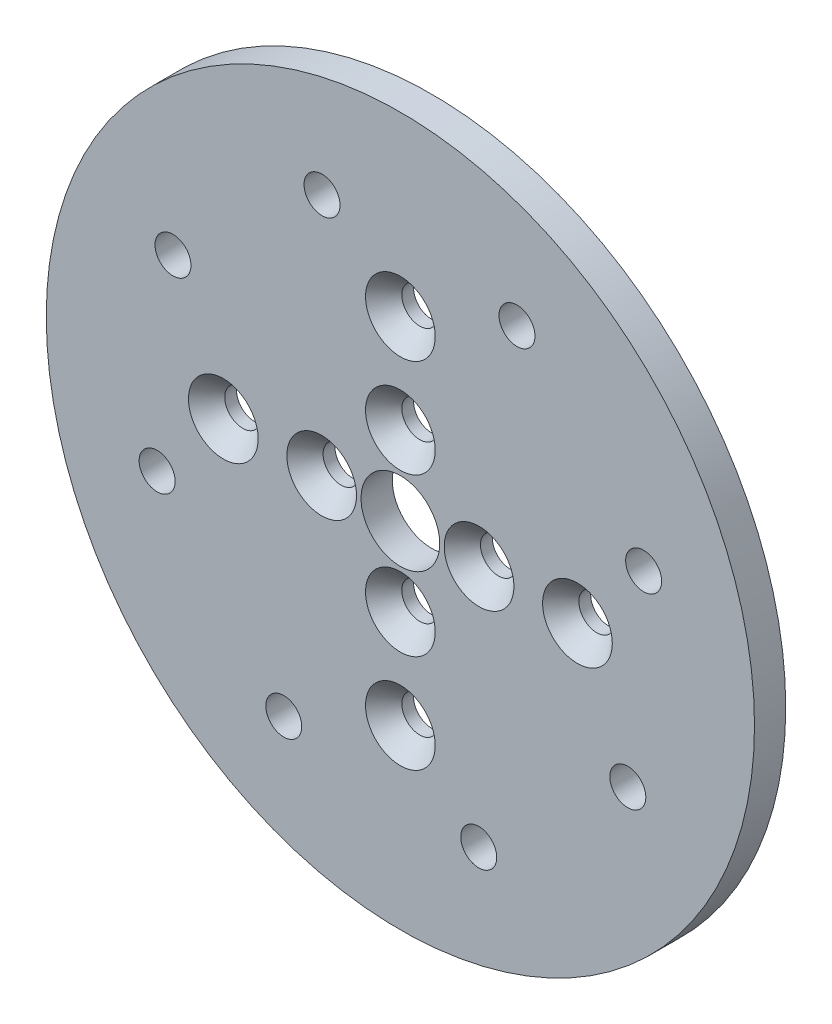
ISO-10303-21;
HEADER;
FILE_DESCRIPTION(('STEP AP214'),'2;1');
FILE_NAME('part.step','',(''),(''),'','','');
FILE_SCHEMA(('AUTOMOTIVE_DESIGN { 1 0 10303 214 1 1 1 1 }'));
ENDSEC;
DATA;
#1=APPLICATION_CONTEXT('core data for automotive mechanical design processes');
#2=APPLICATION_PROTOCOL_DEFINITION('international standard','automotive_design',2000,#1);
#3=PRODUCT_CONTEXT('',#1,'mechanical');
#4=PRODUCT('Part','Part','',(#3));
#5=PRODUCT_RELATED_PRODUCT_CATEGORY('part','',(#4));
#6=PRODUCT_DEFINITION_FORMATION('','',#4);
#7=PRODUCT_DEFINITION_CONTEXT('part definition',#1,'design');
#8=PRODUCT_DEFINITION('design','',#6,#7);
#9=PRODUCT_DEFINITION_SHAPE('','',#8);
#10=(LENGTH_UNIT() NAMED_UNIT(*) SI_UNIT(.MILLI.,.METRE.));
#11=(NAMED_UNIT(*) PLANE_ANGLE_UNIT() SI_UNIT($,.RADIAN.));
#12=(NAMED_UNIT(*) SI_UNIT($,.STERADIAN.) SOLID_ANGLE_UNIT());
#13=UNCERTAINTY_MEASURE_WITH_UNIT(LENGTH_MEASURE(1.E-05),#10,'distance_accuracy_value','');
#14=(GEOMETRIC_REPRESENTATION_CONTEXT(3) GLOBAL_UNCERTAINTY_ASSIGNED_CONTEXT((#13)) GLOBAL_UNIT_ASSIGNED_CONTEXT((#10,
#11,#12)) REPRESENTATION_CONTEXT('',''));
#15=CARTESIAN_POINT('',(0.,0.,0.));
#16=DIRECTION('',(0.,0.,1.));
#17=DIRECTION('',(1.,0.,0.));
#18=AXIS2_PLACEMENT_3D('',#15,#16,#17);
#19=CARTESIAN_POINT('',(0.,0.,3.175));
#20=DIRECTION('',(0.,0.,-1.));
#21=DIRECTION('',(-1.,0.,0.));
#22=AXIS2_PLACEMENT_3D('',#19,#20,#21);
#23=PLANE('',#22);
#24=CARTESIAN_POINT('',(18.0000000000002,-1.66533453693773E-13,3.175));
#25=DIRECTION('',(0.,0.,1.));
#26=DIRECTION('',(1.,0.,0.));
#27=AXIS2_PLACEMENT_3D('',#24,#25,#26);
#28=CIRCLE('',#27,3.5433);
#29=CARTESIAN_POINT('',(21.5433000000002,-1.66533453693773E-13,3.175));
#30=VERTEX_POINT('',#29);
#31=EDGE_CURVE('E90',#30,#30,#28,.T.);
#32=ORIENTED_EDGE('',*,*,#31,.F.);
#33=EDGE_LOOP('',(#32));
#34=FACE_BOUND('',#33,.T.);
#35=CARTESIAN_POINT('',(2.08166817117217E-13,-18.0000000000002,3.175));
#36=DIRECTION('',(0.,0.,1.));
#37=DIRECTION('',(1.,0.,0.));
#38=AXIS2_PLACEMENT_3D('',#35,#36,#37);
#39=CIRCLE('',#38,3.5433);
#40=CARTESIAN_POINT('',(3.54330000000021,-18.0000000000002,3.175));
#41=VERTEX_POINT('',#40);
#42=EDGE_CURVE('E83',#41,#41,#39,.T.);
#43=ORIENTED_EDGE('',*,*,#42,.F.);
#44=EDGE_LOOP('',(#43));
#45=FACE_BOUND('',#44,.T.);
#46=CARTESIAN_POINT('',(-18.0000000000002,0.,3.175));
#47=DIRECTION('',(0.,0.,1.));
#48=DIRECTION('',(1.,0.,0.));
#49=AXIS2_PLACEMENT_3D('',#46,#47,#48);
#50=CIRCLE('',#49,3.5433);
#51=CARTESIAN_POINT('',(-14.4567000000002,0.,3.175));
#52=VERTEX_POINT('',#51);
#53=EDGE_CURVE('E79',#52,#52,#50,.T.);
#54=ORIENTED_EDGE('',*,*,#53,.F.);
#55=EDGE_LOOP('',(#54));
#56=FACE_BOUND('',#55,.T.);
#57=CARTESIAN_POINT('',(0.,8.,3.175));
#58=DIRECTION('',(0.,0.,1.));
#59=DIRECTION('',(1.,0.,0.));
#60=AXIS2_PLACEMENT_3D('',#57,#58,#59);
#61=CIRCLE('',#60,3.5433);
#62=CARTESIAN_POINT('',(3.5433,8.,3.175));
#63=VERTEX_POINT('',#62);
#64=EDGE_CURVE('E75',#63,#63,#61,.T.);
#65=ORIENTED_EDGE('',*,*,#64,.F.);
#66=EDGE_LOOP('',(#65));
#67=FACE_BOUND('',#66,.T.);
#68=CARTESIAN_POINT('',(8.,0.,3.175));
#69=DIRECTION('',(0.,0.,1.));
#70=DIRECTION('',(1.,0.,0.));
#71=AXIS2_PLACEMENT_3D('',#68,#69,#70);
#72=CIRCLE('',#71,3.5433);
#73=CARTESIAN_POINT('',(11.5433,0.,3.175));
#74=VERTEX_POINT('',#73);
#75=EDGE_CURVE('E70',#74,#74,#72,.T.);
#76=ORIENTED_EDGE('',*,*,#75,.F.);
#77=EDGE_LOOP('',(#76));
#78=FACE_BOUND('',#77,.T.);
#79=CARTESIAN_POINT('',(0.,-8.,3.175));
#80=DIRECTION('',(0.,0.,1.));
#81=DIRECTION('',(1.,0.,0.));
#82=AXIS2_PLACEMENT_3D('',#79,#80,#81);
#83=CIRCLE('',#82,3.5433);
#84=CARTESIAN_POINT('',(3.5433,-8.,3.175));
#85=VERTEX_POINT('',#84);
#86=EDGE_CURVE('E65',#85,#85,#83,.T.);
#87=ORIENTED_EDGE('',*,*,#86,.F.);
#88=EDGE_LOOP('',(#87));
#89=FACE_BOUND('',#88,.T.);
#90=CARTESIAN_POINT('',(-8.,0.,3.175));
#91=DIRECTION('',(0.,0.,1.));
#92=DIRECTION('',(1.,0.,0.));
#93=AXIS2_PLACEMENT_3D('',#90,#91,#92);
#94=CIRCLE('',#93,3.5433);
#95=CARTESIAN_POINT('',(-4.4567,0.,3.175));
#96=VERTEX_POINT('',#95);
#97=EDGE_CURVE('E60',#96,#96,#94,.T.);
#98=ORIENTED_EDGE('',*,*,#97,.F.);
#99=EDGE_LOOP('',(#98));
#100=FACE_BOUND('',#99,.T.);
#101=CARTESIAN_POINT('',(-11.8531754583399,-23.1184478621254,3.175));
#102=DIRECTION('',(0.,0.,-1.));
#103=DIRECTION('',(-1.,0.,0.));
#104=AXIS2_PLACEMENT_3D('',#101,#102,#103);
#105=CIRCLE('',#104,1.82879999999999);
#106=CARTESIAN_POINT('',(-13.6819754583399,-23.1184478621254,3.175));
#107=VERTEX_POINT('',#106);
#108=EDGE_CURVE('E122',#107,#107,#105,.T.);
#109=ORIENTED_EDGE('',*,*,#108,.T.);
#110=EDGE_LOOP('',(#109));
#111=FACE_BOUND('',#110,.T.);
#112=CARTESIAN_POINT('',(24.7286719990026,7.96575050863032,3.175));
#113=DIRECTION('',(0.,0.,-1.));
#114=DIRECTION('',(-1.,0.,0.));
#115=AXIS2_PLACEMENT_3D('',#112,#113,#114);
#116=CIRCLE('',#115,1.82879999999999);
#117=CARTESIAN_POINT('',(22.8998719990026,7.96575050863032,3.175));
#118=VERTEX_POINT('',#117);
#119=EDGE_CURVE('E128',#118,#118,#116,.T.);
#120=ORIENTED_EDGE('',*,*,#119,.T.);
#121=EDGE_LOOP('',(#120));
#122=FACE_BOUND('',#121,.T.);
#123=CARTESIAN_POINT('',(11.8531754583399,23.1184478621254,3.175));
#124=DIRECTION('',(0.,0.,-1.));
#125=DIRECTION('',(-1.,0.,0.));
#126=AXIS2_PLACEMENT_3D('',#123,#124,#125);
#127=CIRCLE('',#126,1.82879999999999);
#128=CARTESIAN_POINT('',(10.0243754583399,23.1184478621254,3.175));
#129=VERTEX_POINT('',#128);
#130=EDGE_CURVE('E134',#129,#129,#127,.T.);
#131=ORIENTED_EDGE('',*,*,#130,.T.);
#132=EDGE_LOOP('',(#131));
#133=FACE_BOUND('',#132,.T.);
#134=CARTESIAN_POINT('',(-7.96575050863032,24.7286719990026,3.175));
#135=DIRECTION('',(0.,0.,-1.));
#136=DIRECTION('',(-1.,0.,0.));
#137=AXIS2_PLACEMENT_3D('',#134,#135,#136);
#138=CIRCLE('',#137,1.82879999999999);
#139=CARTESIAN_POINT('',(-9.79455050863031,24.7286719990026,3.175));
#140=VERTEX_POINT('',#139);
#141=EDGE_CURVE('E140',#140,#140,#138,.T.);
#142=ORIENTED_EDGE('',*,*,#141,.T.);
#143=EDGE_LOOP('',(#142));
#144=FACE_BOUND('',#143,.T.);
#145=CARTESIAN_POINT('',(-23.1184478621253,11.85317545834,3.175));
#146=DIRECTION('',(0.,0.,-1.));
#147=DIRECTION('',(-1.,0.,0.));
#148=AXIS2_PLACEMENT_3D('',#145,#146,#147);
#149=CIRCLE('',#148,1.82879999999999);
#150=CARTESIAN_POINT('',(-24.9472478621253,11.85317545834,3.175));
#151=VERTEX_POINT('',#150);
#152=EDGE_CURVE('E146',#151,#151,#149,.T.);
#153=ORIENTED_EDGE('',*,*,#152,.T.);
#154=EDGE_LOOP('',(#153));
#155=FACE_BOUND('',#154,.T.);
#156=CARTESIAN_POINT('',(-24.7286719990026,-7.96575050863032,3.175));
#157=DIRECTION('',(0.,0.,-1.));
#158=DIRECTION('',(-1.,0.,0.));
#159=AXIS2_PLACEMENT_3D('',#156,#157,#158);
#160=CIRCLE('',#159,1.82879999999999);
#161=CARTESIAN_POINT('',(-26.5574719990026,-7.96575050863032,3.175));
#162=VERTEX_POINT('',#161);
#163=EDGE_CURVE('E152',#162,#162,#160,.T.);
#164=ORIENTED_EDGE('',*,*,#163,.T.);
#165=EDGE_LOOP('',(#164));
#166=FACE_BOUND('',#165,.T.);
#167=CARTESIAN_POINT('',(7.96575050863032,-24.7286719990026,3.175));
#168=DIRECTION('',(0.,0.,-1.));
#169=DIRECTION('',(-1.,0.,0.));
#170=AXIS2_PLACEMENT_3D('',#167,#168,#169);
#171=CIRCLE('',#170,1.82879999999999);
#172=CARTESIAN_POINT('',(6.13695050863033,-24.7286719990026,3.175));
#173=VERTEX_POINT('',#172);
#174=EDGE_CURVE('E158',#173,#173,#171,.T.);
#175=ORIENTED_EDGE('',*,*,#174,.T.);
#176=EDGE_LOOP('',(#175));
#177=FACE_BOUND('',#176,.T.);
#178=CARTESIAN_POINT('',(23.1184478621253,-11.85317545834,3.175));
#179=DIRECTION('',(0.,0.,-1.));
#180=DIRECTION('',(-1.,0.,0.));
#181=AXIS2_PLACEMENT_3D('',#178,#179,#180);
#182=CIRCLE('',#181,1.82879999999999);
#183=CARTESIAN_POINT('',(21.2896478621253,-11.85317545834,3.175));
#184=VERTEX_POINT('',#183);
#185=EDGE_CURVE('E164',#184,#184,#182,.T.);
#186=ORIENTED_EDGE('',*,*,#185,.T.);
#187=EDGE_LOOP('',(#186));
#188=FACE_BOUND('',#187,.T.);
#189=CARTESIAN_POINT('',(0.,0.,3.175));
#190=DIRECTION('',(0.,0.,1.));
#191=DIRECTION('',(-1.,0.,0.));
#192=AXIS2_PLACEMENT_3D('',#189,#190,#191);
#193=CIRCLE('',#192,36.);
#194=CARTESIAN_POINT('',(-36.,0.,3.175));
#195=VERTEX_POINT('',#194);
#196=EDGE_CURVE('E10',#195,#195,#193,.T.);
#197=ORIENTED_EDGE('',*,*,#196,.T.);
#198=EDGE_LOOP('',(#197));
#199=FACE_BOUND('',#198,.T.);
#200=CARTESIAN_POINT('',(0.,0.,3.175));
#201=DIRECTION('',(0.,0.,1.));
#202=DIRECTION('',(1.,0.,0.));
#203=AXIS2_PLACEMENT_3D('',#200,#201,#202);
#204=CIRCLE('',#203,4.);
#205=CARTESIAN_POINT('',(4.00000000000001,0.,3.175));
#206=VERTEX_POINT('',#205);
#207=EDGE_CURVE('E46',#206,#206,#204,.T.);
#208=ORIENTED_EDGE('',*,*,#207,.F.);
#209=EDGE_LOOP('',(#208));
#210=FACE_BOUND('',#209,.T.);
#211=CARTESIAN_POINT('',(2.08166817117217E-13,17.9999999999998,3.175));
#212=DIRECTION('',(0.,0.,1.));
#213=DIRECTION('',(1.,0.,0.));
#214=AXIS2_PLACEMENT_3D('',#211,#212,#213);
#215=CIRCLE('',#214,3.5433);
#216=CARTESIAN_POINT('',(3.54330000000021,17.9999999999998,3.175));
#217=VERTEX_POINT('',#216);
#218=EDGE_CURVE('E226',#217,#217,#215,.T.);
#219=ORIENTED_EDGE('',*,*,#218,.F.);
#220=EDGE_LOOP('',(#219));
#221=FACE_BOUND('',#220,.T.);
#222=ADVANCED_FACE('F33',(#34,#45,#56,#67,#78,#89,#100,#111,#122,#133,#144,#155,#166,#177,#188,
#199,#210,#221),#23,.F.);
#223=CARTESIAN_POINT('',(0.,0.,0.));
#224=DIRECTION('',(0.,0.,-1.));
#225=DIRECTION('',(-1.,0.,0.));
#226=AXIS2_PLACEMENT_3D('',#223,#224,#225);
#227=PLANE('',#226);
#228=CARTESIAN_POINT('',(2.08166817117217E-13,17.9999999999998,0.));
#229=DIRECTION('',(0.,0.,-1.));
#230=DIRECTION('',(-1.,0.,0.));
#231=AXIS2_PLACEMENT_3D('',#228,#229,#230);
#232=CIRCLE('',#231,1.82879999999999);
#233=CARTESIAN_POINT('',(-1.82879999999978,17.9999999999998,0.));
#234=VERTEX_POINT('',#233);
#235=EDGE_CURVE('E37',#234,#234,#232,.T.);
#236=ORIENTED_EDGE('',*,*,#235,.F.);
#237=EDGE_LOOP('',(#236));
#238=FACE_BOUND('',#237,.T.);
#239=CARTESIAN_POINT('',(18.0000000000002,-1.66533453693773E-13,0.));
#240=DIRECTION('',(0.,0.,-1.));
#241=DIRECTION('',(-1.,0.,0.));
#242=AXIS2_PLACEMENT_3D('',#239,#240,#241);
#243=CIRCLE('',#242,1.82879999999999);
#244=CARTESIAN_POINT('',(16.1712000000002,-1.66533453693773E-13,0.));
#245=VERTEX_POINT('',#244);
#246=EDGE_CURVE('E81',#245,#245,#243,.T.);
#247=ORIENTED_EDGE('',*,*,#246,.F.);
#248=EDGE_LOOP('',(#247));
#249=FACE_BOUND('',#248,.T.);
#250=CARTESIAN_POINT('',(2.08166817117217E-13,-18.0000000000002,0.));
#251=DIRECTION('',(0.,0.,-1.));
#252=DIRECTION('',(-1.,0.,0.));
#253=AXIS2_PLACEMENT_3D('',#250,#251,#252);
#254=CIRCLE('',#253,1.82879999999999);
#255=CARTESIAN_POINT('',(-1.82879999999978,-18.0000000000002,0.));
#256=VERTEX_POINT('',#255);
#257=EDGE_CURVE('E77',#256,#256,#254,.T.);
#258=ORIENTED_EDGE('',*,*,#257,.F.);
#259=EDGE_LOOP('',(#258));
#260=FACE_BOUND('',#259,.T.);
#261=CARTESIAN_POINT('',(-18.0000000000002,0.,0.));
#262=DIRECTION('',(0.,0.,-1.));
#263=DIRECTION('',(-1.,0.,0.));
#264=AXIS2_PLACEMENT_3D('',#261,#262,#263);
#265=CIRCLE('',#264,1.82879999999999);
#266=CARTESIAN_POINT('',(-19.8288000000002,0.,0.));
#267=VERTEX_POINT('',#266);
#268=EDGE_CURVE('E72',#267,#267,#265,.T.);
#269=ORIENTED_EDGE('',*,*,#268,.F.);
#270=EDGE_LOOP('',(#269));
#271=FACE_BOUND('',#270,.T.);
#272=CARTESIAN_POINT('',(0.,8.,0.));
#273=DIRECTION('',(0.,0.,-1.));
#274=DIRECTION('',(-1.,0.,0.));
#275=AXIS2_PLACEMENT_3D('',#272,#273,#274);
#276=CIRCLE('',#275,1.82879999999999);
#277=CARTESIAN_POINT('',(-1.82879999999999,8.,0.));
#278=VERTEX_POINT('',#277);
#279=EDGE_CURVE('E67',#278,#278,#276,.T.);
#280=ORIENTED_EDGE('',*,*,#279,.F.);
#281=EDGE_LOOP('',(#280));
#282=FACE_BOUND('',#281,.T.);
#283=CARTESIAN_POINT('',(8.,0.,0.));
#284=DIRECTION('',(0.,0.,-1.));
#285=DIRECTION('',(-1.,0.,0.));
#286=AXIS2_PLACEMENT_3D('',#283,#284,#285);
#287=CIRCLE('',#286,1.82879999999999);
#288=CARTESIAN_POINT('',(6.17120000000001,0.,0.));
#289=VERTEX_POINT('',#288);
#290=EDGE_CURVE('E62',#289,#289,#287,.T.);
#291=ORIENTED_EDGE('',*,*,#290,.F.);
#292=EDGE_LOOP('',(#291));
#293=FACE_BOUND('',#292,.T.);
#294=CARTESIAN_POINT('',(0.,-8.,0.));
#295=DIRECTION('',(0.,0.,-1.));
#296=DIRECTION('',(-1.,0.,0.));
#297=AXIS2_PLACEMENT_3D('',#294,#295,#296);
#298=CIRCLE('',#297,1.82879999999999);
#299=CARTESIAN_POINT('',(-1.82879999999999,-8.,0.));
#300=VERTEX_POINT('',#299);
#301=EDGE_CURVE('E57',#300,#300,#298,.T.);
#302=ORIENTED_EDGE('',*,*,#301,.F.);
#303=EDGE_LOOP('',(#302));
#304=FACE_BOUND('',#303,.T.);
#305=CARTESIAN_POINT('',(-8.,0.,0.));
#306=DIRECTION('',(0.,0.,-1.));
#307=DIRECTION('',(-1.,0.,0.));
#308=AXIS2_PLACEMENT_3D('',#305,#306,#307);
#309=CIRCLE('',#308,1.82879999999999);
#310=CARTESIAN_POINT('',(-9.82879999999999,0.,0.));
#311=VERTEX_POINT('',#310);
#312=EDGE_CURVE('E52',#311,#311,#309,.T.);
#313=ORIENTED_EDGE('',*,*,#312,.F.);
#314=EDGE_LOOP('',(#313));
#315=FACE_BOUND('',#314,.T.);
#316=CARTESIAN_POINT('',(-11.8531754583399,-23.1184478621254,0.));
#317=DIRECTION('',(0.,0.,-1.));
#318=DIRECTION('',(-1.,0.,0.));
#319=AXIS2_PLACEMENT_3D('',#316,#317,#318);
#320=CIRCLE('',#319,1.82879999999999);
#321=CARTESIAN_POINT('',(-13.6819754583399,-23.1184478621254,0.));
#322=VERTEX_POINT('',#321);
#323=EDGE_CURVE('E55',#322,#322,#320,.T.);
#324=ORIENTED_EDGE('',*,*,#323,.F.);
#325=EDGE_LOOP('',(#324));
#326=FACE_BOUND('',#325,.T.);
#327=CARTESIAN_POINT('',(24.7286719990026,7.96575050863032,0.));
#328=DIRECTION('',(0.,0.,-1.));
#329=DIRECTION('',(-1.,0.,0.));
#330=AXIS2_PLACEMENT_3D('',#327,#328,#329);
#331=CIRCLE('',#330,1.82879999999999);
#332=CARTESIAN_POINT('',(22.8998719990026,7.96575050863032,0.));
#333=VERTEX_POINT('',#332);
#334=EDGE_CURVE('E125',#333,#333,#331,.T.);
#335=ORIENTED_EDGE('',*,*,#334,.F.);
#336=EDGE_LOOP('',(#335));
#337=FACE_BOUND('',#336,.T.);
#338=CARTESIAN_POINT('',(11.8531754583399,23.1184478621254,0.));
#339=DIRECTION('',(0.,0.,-1.));
#340=DIRECTION('',(-1.,0.,0.));
#341=AXIS2_PLACEMENT_3D('',#338,#339,#340);
#342=CIRCLE('',#341,1.82879999999999);
#343=CARTESIAN_POINT('',(10.0243754583399,23.1184478621254,0.));
#344=VERTEX_POINT('',#343);
#345=EDGE_CURVE('E131',#344,#344,#342,.T.);
#346=ORIENTED_EDGE('',*,*,#345,.F.);
#347=EDGE_LOOP('',(#346));
#348=FACE_BOUND('',#347,.T.);
#349=CARTESIAN_POINT('',(-7.96575050863032,24.7286719990026,0.));
#350=DIRECTION('',(0.,0.,-1.));
#351=DIRECTION('',(-1.,0.,0.));
#352=AXIS2_PLACEMENT_3D('',#349,#350,#351);
#353=CIRCLE('',#352,1.82879999999999);
#354=CARTESIAN_POINT('',(-9.79455050863031,24.7286719990026,0.));
#355=VERTEX_POINT('',#354);
#356=EDGE_CURVE('E137',#355,#355,#353,.T.);
#357=ORIENTED_EDGE('',*,*,#356,.F.);
#358=EDGE_LOOP('',(#357));
#359=FACE_BOUND('',#358,.T.);
#360=CARTESIAN_POINT('',(-23.1184478621253,11.85317545834,0.));
#361=DIRECTION('',(0.,0.,-1.));
#362=DIRECTION('',(-1.,0.,0.));
#363=AXIS2_PLACEMENT_3D('',#360,#361,#362);
#364=CIRCLE('',#363,1.82879999999999);
#365=CARTESIAN_POINT('',(-24.9472478621253,11.85317545834,0.));
#366=VERTEX_POINT('',#365);
#367=EDGE_CURVE('E143',#366,#366,#364,.T.);
#368=ORIENTED_EDGE('',*,*,#367,.F.);
#369=EDGE_LOOP('',(#368));
#370=FACE_BOUND('',#369,.T.);
#371=CARTESIAN_POINT('',(-24.7286719990026,-7.96575050863032,0.));
#372=DIRECTION('',(0.,0.,-1.));
#373=DIRECTION('',(-1.,0.,0.));
#374=AXIS2_PLACEMENT_3D('',#371,#372,#373);
#375=CIRCLE('',#374,1.82879999999999);
#376=CARTESIAN_POINT('',(-26.5574719990026,-7.96575050863032,0.));
#377=VERTEX_POINT('',#376);
#378=EDGE_CURVE('E149',#377,#377,#375,.T.);
#379=ORIENTED_EDGE('',*,*,#378,.F.);
#380=EDGE_LOOP('',(#379));
#381=FACE_BOUND('',#380,.T.);
#382=CARTESIAN_POINT('',(7.96575050863032,-24.7286719990026,0.));
#383=DIRECTION('',(0.,0.,-1.));
#384=DIRECTION('',(-1.,0.,0.));
#385=AXIS2_PLACEMENT_3D('',#382,#383,#384);
#386=CIRCLE('',#385,1.82879999999999);
#387=CARTESIAN_POINT('',(6.13695050863033,-24.7286719990026,0.));
#388=VERTEX_POINT('',#387);
#389=EDGE_CURVE('E155',#388,#388,#386,.T.);
#390=ORIENTED_EDGE('',*,*,#389,.F.);
#391=EDGE_LOOP('',(#390));
#392=FACE_BOUND('',#391,.T.);
#393=CARTESIAN_POINT('',(23.1184478621253,-11.85317545834,0.));
#394=DIRECTION('',(0.,0.,-1.));
#395=DIRECTION('',(-1.,0.,0.));
#396=AXIS2_PLACEMENT_3D('',#393,#394,#395);
#397=CIRCLE('',#396,1.82879999999999);
#398=CARTESIAN_POINT('',(21.2896478621253,-11.85317545834,0.));
#399=VERTEX_POINT('',#398);
#400=EDGE_CURVE('E161',#399,#399,#397,.T.);
#401=ORIENTED_EDGE('',*,*,#400,.F.);
#402=EDGE_LOOP('',(#401));
#403=FACE_BOUND('',#402,.T.);
#404=CARTESIAN_POINT('',(0.,0.,0.));
#405=DIRECTION('',(0.,0.,1.));
#406=DIRECTION('',(1.,0.,0.));
#407=AXIS2_PLACEMENT_3D('',#404,#405,#406);
#408=CIRCLE('',#407,36.);
#409=CARTESIAN_POINT('',(36.,0.,0.));
#410=VERTEX_POINT('',#409);
#411=EDGE_CURVE('E41',#410,#410,#408,.T.);
#412=ORIENTED_EDGE('',*,*,#411,.F.);
#413=EDGE_LOOP('',(#412));
#414=FACE_BOUND('',#413,.T.);
#415=CARTESIAN_POINT('',(0.,0.,0.));
#416=DIRECTION('',(0.,0.,1.));
#417=DIRECTION('',(1.,0.,0.));
#418=AXIS2_PLACEMENT_3D('',#415,#416,#417);
#419=CIRCLE('',#418,4.);
#420=CARTESIAN_POINT('',(4.00000000000001,0.,0.));
#421=VERTEX_POINT('',#420);
#422=EDGE_CURVE('E49',#421,#421,#419,.T.);
#423=ORIENTED_EDGE('',*,*,#422,.T.);
#424=EDGE_LOOP('',(#423));
#425=FACE_BOUND('',#424,.T.);
#426=ADVANCED_FACE('F172',(#238,#249,#260,#271,#282,#293,#304,#315,#326,#337,#348,#359,#370,
#381,#392,#403,#414,#425),#227,.T.);
#427=CARTESIAN_POINT('',(0.,0.,3.175));
#428=DIRECTION('',(0.,0.,-1.));
#429=DIRECTION('',(-1.,0.,0.));
#430=AXIS2_PLACEMENT_3D('',#427,#428,#429);
#431=CYLINDRICAL_SURFACE('',#430,36.);
#432=ORIENTED_EDGE('',*,*,#411,.T.);
#433=EDGE_LOOP('',(#432));
#434=FACE_BOUND('',#433,.T.);
#435=ORIENTED_EDGE('',*,*,#196,.F.);
#436=EDGE_LOOP('',(#435));
#437=FACE_BOUND('',#436,.T.);
#438=ADVANCED_FACE('F35',(#434,#437),#431,.T.);
#439=CARTESIAN_POINT('',(0.,0.,3.175));
#440=DIRECTION('',(0.,0.,-1.));
#441=DIRECTION('',(-1.,0.,0.));
#442=AXIS2_PLACEMENT_3D('',#439,#440,#441);
#443=CYLINDRICAL_SURFACE('',#442,4.);
#444=ORIENTED_EDGE('',*,*,#207,.T.);
#445=EDGE_LOOP('',(#444));
#446=FACE_BOUND('',#445,.T.);
#447=ORIENTED_EDGE('',*,*,#422,.F.);
#448=EDGE_LOOP('',(#447));
#449=FACE_BOUND('',#448,.T.);
#450=ADVANCED_FACE('F174',(#446,#449),#443,.F.);
#451=CARTESIAN_POINT('',(23.1184478621253,-11.85317545834,0.));
#452=DIRECTION('',(0.,0.,-1.));
#453=DIRECTION('',(-1.,0.,0.));
#454=AXIS2_PLACEMENT_3D('',#451,#452,#453);
#455=CYLINDRICAL_SURFACE('',#454,1.82879999999999);
#456=ORIENTED_EDGE('',*,*,#400,.T.);
#457=EDGE_LOOP('',(#456));
#458=FACE_BOUND('',#457,.T.);
#459=ORIENTED_EDGE('',*,*,#185,.F.);
#460=EDGE_LOOP('',(#459));
#461=FACE_BOUND('',#460,.T.);
#462=ADVANCED_FACE('F176',(#458,#461),#455,.F.);
#463=CARTESIAN_POINT('',(7.96575050863032,-24.7286719990026,0.));
#464=DIRECTION('',(0.,0.,-1.));
#465=DIRECTION('',(-1.,0.,0.));
#466=AXIS2_PLACEMENT_3D('',#463,#464,#465);
#467=CYLINDRICAL_SURFACE('',#466,1.82879999999999);
#468=ORIENTED_EDGE('',*,*,#389,.T.);
#469=EDGE_LOOP('',(#468));
#470=FACE_BOUND('',#469,.T.);
#471=ORIENTED_EDGE('',*,*,#174,.F.);
#472=EDGE_LOOP('',(#471));
#473=FACE_BOUND('',#472,.T.);
#474=ADVANCED_FACE('F182',(#470,#473),#467,.F.);
#475=CARTESIAN_POINT('',(-24.7286719990026,-7.96575050863032,0.));
#476=DIRECTION('',(0.,0.,-1.));
#477=DIRECTION('',(-1.,0.,0.));
#478=AXIS2_PLACEMENT_3D('',#475,#476,#477);
#479=CYLINDRICAL_SURFACE('',#478,1.82879999999999);
#480=ORIENTED_EDGE('',*,*,#378,.T.);
#481=EDGE_LOOP('',(#480));
#482=FACE_BOUND('',#481,.T.);
#483=ORIENTED_EDGE('',*,*,#163,.F.);
#484=EDGE_LOOP('',(#483));
#485=FACE_BOUND('',#484,.T.);
#486=ADVANCED_FACE('F273',(#482,#485),#479,.F.);
#487=CARTESIAN_POINT('',(-23.1184478621253,11.85317545834,0.));
#488=DIRECTION('',(0.,0.,-1.));
#489=DIRECTION('',(-1.,0.,0.));
#490=AXIS2_PLACEMENT_3D('',#487,#488,#489);
#491=CYLINDRICAL_SURFACE('',#490,1.82879999999999);
#492=ORIENTED_EDGE('',*,*,#367,.T.);
#493=EDGE_LOOP('',(#492));
#494=FACE_BOUND('',#493,.T.);
#495=ORIENTED_EDGE('',*,*,#152,.F.);
#496=EDGE_LOOP('',(#495));
#497=FACE_BOUND('',#496,.T.);
#498=ADVANCED_FACE('F278',(#494,#497),#491,.F.);
#499=CARTESIAN_POINT('',(-7.96575050863032,24.7286719990026,0.));
#500=DIRECTION('',(0.,0.,-1.));
#501=DIRECTION('',(-1.,0.,0.));
#502=AXIS2_PLACEMENT_3D('',#499,#500,#501);
#503=CYLINDRICAL_SURFACE('',#502,1.82879999999999);
#504=ORIENTED_EDGE('',*,*,#356,.T.);
#505=EDGE_LOOP('',(#504));
#506=FACE_BOUND('',#505,.T.);
#507=ORIENTED_EDGE('',*,*,#141,.F.);
#508=EDGE_LOOP('',(#507));
#509=FACE_BOUND('',#508,.T.);
#510=ADVANCED_FACE('F284',(#506,#509),#503,.F.);
#511=CARTESIAN_POINT('',(11.8531754583399,23.1184478621254,0.));
#512=DIRECTION('',(0.,0.,-1.));
#513=DIRECTION('',(-1.,0.,0.));
#514=AXIS2_PLACEMENT_3D('',#511,#512,#513);
#515=CYLINDRICAL_SURFACE('',#514,1.82879999999999);
#516=ORIENTED_EDGE('',*,*,#345,.T.);
#517=EDGE_LOOP('',(#516));
#518=FACE_BOUND('',#517,.T.);
#519=ORIENTED_EDGE('',*,*,#130,.F.);
#520=EDGE_LOOP('',(#519));
#521=FACE_BOUND('',#520,.T.);
#522=ADVANCED_FACE('F288',(#518,#521),#515,.F.);
#523=CARTESIAN_POINT('',(24.7286719990026,7.96575050863032,0.));
#524=DIRECTION('',(0.,0.,-1.));
#525=DIRECTION('',(-1.,0.,0.));
#526=AXIS2_PLACEMENT_3D('',#523,#524,#525);
#527=CYLINDRICAL_SURFACE('',#526,1.82879999999999);
#528=ORIENTED_EDGE('',*,*,#334,.T.);
#529=EDGE_LOOP('',(#528));
#530=FACE_BOUND('',#529,.T.);
#531=ORIENTED_EDGE('',*,*,#119,.F.);
#532=EDGE_LOOP('',(#531));
#533=FACE_BOUND('',#532,.T.);
#534=ADVANCED_FACE('F292',(#530,#533),#527,.F.);
#535=CARTESIAN_POINT('',(-11.8531754583399,-23.1184478621254,0.));
#536=DIRECTION('',(0.,0.,-1.));
#537=DIRECTION('',(-1.,0.,0.));
#538=AXIS2_PLACEMENT_3D('',#535,#536,#537);
#539=CYLINDRICAL_SURFACE('',#538,1.82879999999999);
#540=ORIENTED_EDGE('',*,*,#323,.T.);
#541=EDGE_LOOP('',(#540));
#542=FACE_BOUND('',#541,.T.);
#543=ORIENTED_EDGE('',*,*,#108,.F.);
#544=EDGE_LOOP('',(#543));
#545=FACE_BOUND('',#544,.T.);
#546=ADVANCED_FACE('F296',(#542,#545),#539,.F.);
#547=CARTESIAN_POINT('',(-8.,0.,3.175));
#548=DIRECTION('',(0.,0.,1.));
#549=DIRECTION('',(1.,0.,0.));
#550=AXIS2_PLACEMENT_3D('',#547,#548,#549);
#551=CYLINDRICAL_SURFACE('',#550,1.82879999999999);
#552=ORIENTED_EDGE('',*,*,#312,.T.);
#553=EDGE_LOOP('',(#552));
#554=FACE_BOUND('',#553,.T.);
#555=CARTESIAN_POINT('',(-8.,0.,1.20269336581956));
#556=DIRECTION('',(0.,0.,1.));
#557=DIRECTION('',(1.,0.,0.));
#558=AXIS2_PLACEMENT_3D('',#555,#556,#557);
#559=CIRCLE('',#558,1.82879999999999);
#560=CARTESIAN_POINT('',(-6.17120000000001,0.,1.20269336581956));
#561=VERTEX_POINT('',#560);
#562=EDGE_CURVE('E56',#561,#561,#559,.T.);
#563=ORIENTED_EDGE('',*,*,#562,.T.);
#564=EDGE_LOOP('',(#563));
#565=FACE_BOUND('',#564,.T.);
#566=ADVANCED_FACE('F300',(#554,#565),#551,.F.);
#567=CARTESIAN_POINT('',(-8.,0.,3.175));
#568=DIRECTION('',(0.,0.,1.));
#569=DIRECTION('',(1.,0.,0.));
#570=AXIS2_PLACEMENT_3D('',#567,#568,#569);
#571=CONICAL_SURFACE('',#570,3.5433,0.715584993317673);
#572=ORIENTED_EDGE('',*,*,#562,.F.);
#573=EDGE_LOOP('',(#572));
#574=FACE_BOUND('',#573,.T.);
#575=ORIENTED_EDGE('',*,*,#97,.T.);
#576=EDGE_LOOP('',(#575));
#577=FACE_BOUND('',#576,.T.);
#578=ADVANCED_FACE('F304',(#574,#577),#571,.F.);
#579=CARTESIAN_POINT('',(0.,-8.,3.175));
#580=DIRECTION('',(0.,0.,1.));
#581=DIRECTION('',(1.,0.,0.));
#582=AXIS2_PLACEMENT_3D('',#579,#580,#581);
#583=CYLINDRICAL_SURFACE('',#582,1.82879999999999);
#584=ORIENTED_EDGE('',*,*,#301,.T.);
#585=EDGE_LOOP('',(#584));
#586=FACE_BOUND('',#585,.T.);
#587=CARTESIAN_POINT('',(0.,-8.,1.20269336581956));
#588=DIRECTION('',(0.,0.,1.));
#589=DIRECTION('',(1.,0.,0.));
#590=AXIS2_PLACEMENT_3D('',#587,#588,#589);
#591=CIRCLE('',#590,1.82879999999999);
#592=CARTESIAN_POINT('',(1.82879999999999,-8.,1.20269336581956));
#593=VERTEX_POINT('',#592);
#594=EDGE_CURVE('E61',#593,#593,#591,.T.);
#595=ORIENTED_EDGE('',*,*,#594,.T.);
#596=EDGE_LOOP('',(#595));
#597=FACE_BOUND('',#596,.T.);
#598=ADVANCED_FACE('F308',(#586,#597),#583,.F.);
#599=CARTESIAN_POINT('',(0.,-8.,3.175));
#600=DIRECTION('',(0.,0.,1.));
#601=DIRECTION('',(1.,0.,0.));
#602=AXIS2_PLACEMENT_3D('',#599,#600,#601);
#603=CONICAL_SURFACE('',#602,3.5433,0.715584993317673);
#604=ORIENTED_EDGE('',*,*,#594,.F.);
#605=EDGE_LOOP('',(#604));
#606=FACE_BOUND('',#605,.T.);
#607=ORIENTED_EDGE('',*,*,#86,.T.);
#608=EDGE_LOOP('',(#607));
#609=FACE_BOUND('',#608,.T.);
#610=ADVANCED_FACE('F312',(#606,#609),#603,.F.);
#611=CARTESIAN_POINT('',(8.,0.,3.175));
#612=DIRECTION('',(0.,0.,1.));
#613=DIRECTION('',(1.,0.,0.));
#614=AXIS2_PLACEMENT_3D('',#611,#612,#613);
#615=CYLINDRICAL_SURFACE('',#614,1.82879999999999);
#616=ORIENTED_EDGE('',*,*,#290,.T.);
#617=EDGE_LOOP('',(#616));
#618=FACE_BOUND('',#617,.T.);
#619=CARTESIAN_POINT('',(8.,0.,1.20269336581956));
#620=DIRECTION('',(0.,0.,1.));
#621=DIRECTION('',(1.,0.,0.));
#622=AXIS2_PLACEMENT_3D('',#619,#620,#621);
#623=CIRCLE('',#622,1.82879999999999);
#624=CARTESIAN_POINT('',(9.82879999999999,0.,1.20269336581956));
#625=VERTEX_POINT('',#624);
#626=EDGE_CURVE('E66',#625,#625,#623,.T.);
#627=ORIENTED_EDGE('',*,*,#626,.T.);
#628=EDGE_LOOP('',(#627));
#629=FACE_BOUND('',#628,.T.);
#630=ADVANCED_FACE('F316',(#618,#629),#615,.F.);
#631=CARTESIAN_POINT('',(8.,0.,3.175));
#632=DIRECTION('',(0.,0.,1.));
#633=DIRECTION('',(1.,0.,0.));
#634=AXIS2_PLACEMENT_3D('',#631,#632,#633);
#635=CONICAL_SURFACE('',#634,3.5433,0.715584993317673);
#636=ORIENTED_EDGE('',*,*,#626,.F.);
#637=EDGE_LOOP('',(#636));
#638=FACE_BOUND('',#637,.T.);
#639=ORIENTED_EDGE('',*,*,#75,.T.);
#640=EDGE_LOOP('',(#639));
#641=FACE_BOUND('',#640,.T.);
#642=ADVANCED_FACE('F320',(#638,#641),#635,.F.);
#643=CARTESIAN_POINT('',(0.,8.,3.175));
#644=DIRECTION('',(0.,0.,1.));
#645=DIRECTION('',(1.,0.,0.));
#646=AXIS2_PLACEMENT_3D('',#643,#644,#645);
#647=CYLINDRICAL_SURFACE('',#646,1.82879999999999);
#648=ORIENTED_EDGE('',*,*,#279,.T.);
#649=EDGE_LOOP('',(#648));
#650=FACE_BOUND('',#649,.T.);
#651=CARTESIAN_POINT('',(0.,8.,1.20269336581956));
#652=DIRECTION('',(0.,0.,1.));
#653=DIRECTION('',(1.,0.,0.));
#654=AXIS2_PLACEMENT_3D('',#651,#652,#653);
#655=CIRCLE('',#654,1.82879999999999);
#656=CARTESIAN_POINT('',(1.82879999999999,8.,1.20269336581956));
#657=VERTEX_POINT('',#656);
#658=EDGE_CURVE('E71',#657,#657,#655,.T.);
#659=ORIENTED_EDGE('',*,*,#658,.T.);
#660=EDGE_LOOP('',(#659));
#661=FACE_BOUND('',#660,.T.);
#662=ADVANCED_FACE('F324',(#650,#661),#647,.F.);
#663=CARTESIAN_POINT('',(0.,8.,3.175));
#664=DIRECTION('',(0.,0.,1.));
#665=DIRECTION('',(1.,0.,0.));
#666=AXIS2_PLACEMENT_3D('',#663,#664,#665);
#667=CONICAL_SURFACE('',#666,3.5433,0.715584993317673);
#668=ORIENTED_EDGE('',*,*,#658,.F.);
#669=EDGE_LOOP('',(#668));
#670=FACE_BOUND('',#669,.T.);
#671=ORIENTED_EDGE('',*,*,#64,.T.);
#672=EDGE_LOOP('',(#671));
#673=FACE_BOUND('',#672,.T.);
#674=ADVANCED_FACE('F328',(#670,#673),#667,.F.);
#675=CARTESIAN_POINT('',(-18.0000000000002,0.,3.175));
#676=DIRECTION('',(0.,0.,1.));
#677=DIRECTION('',(1.,0.,0.));
#678=AXIS2_PLACEMENT_3D('',#675,#676,#677);
#679=CYLINDRICAL_SURFACE('',#678,1.82879999999999);
#680=ORIENTED_EDGE('',*,*,#268,.T.);
#681=EDGE_LOOP('',(#680));
#682=FACE_BOUND('',#681,.T.);
#683=CARTESIAN_POINT('',(-18.0000000000002,0.,1.20269336581956));
#684=DIRECTION('',(0.,0.,1.));
#685=DIRECTION('',(1.,0.,0.));
#686=AXIS2_PLACEMENT_3D('',#683,#684,#685);
#687=CIRCLE('',#686,1.82879999999999);
#688=CARTESIAN_POINT('',(-16.1712000000002,0.,1.20269336581956));
#689=VERTEX_POINT('',#688);
#690=EDGE_CURVE('E76',#689,#689,#687,.T.);
#691=ORIENTED_EDGE('',*,*,#690,.T.);
#692=EDGE_LOOP('',(#691));
#693=FACE_BOUND('',#692,.T.);
#694=ADVANCED_FACE('F332',(#682,#693),#679,.F.);
#695=CARTESIAN_POINT('',(-18.0000000000002,0.,3.175));
#696=DIRECTION('',(0.,0.,1.));
#697=DIRECTION('',(1.,0.,0.));
#698=AXIS2_PLACEMENT_3D('',#695,#696,#697);
#699=CONICAL_SURFACE('',#698,3.5433,0.715584993317674);
#700=ORIENTED_EDGE('',*,*,#690,.F.);
#701=EDGE_LOOP('',(#700));
#702=FACE_BOUND('',#701,.T.);
#703=ORIENTED_EDGE('',*,*,#53,.T.);
#704=EDGE_LOOP('',(#703));
#705=FACE_BOUND('',#704,.T.);
#706=ADVANCED_FACE('F336',(#702,#705),#699,.F.);
#707=CARTESIAN_POINT('',(2.08166817117217E-13,-18.0000000000002,3.175));
#708=DIRECTION('',(0.,0.,1.));
#709=DIRECTION('',(1.,0.,0.));
#710=AXIS2_PLACEMENT_3D('',#707,#708,#709);
#711=CYLINDRICAL_SURFACE('',#710,1.82879999999999);
#712=ORIENTED_EDGE('',*,*,#257,.T.);
#713=EDGE_LOOP('',(#712));
#714=FACE_BOUND('',#713,.T.);
#715=CARTESIAN_POINT('',(2.08166817117217E-13,-18.0000000000002,1.20269336581956));
#716=DIRECTION('',(0.,0.,1.));
#717=DIRECTION('',(1.,0.,0.));
#718=AXIS2_PLACEMENT_3D('',#715,#716,#717);
#719=CIRCLE('',#718,1.82879999999999);
#720=CARTESIAN_POINT('',(1.8288000000002,-18.0000000000002,1.20269336581956));
#721=VERTEX_POINT('',#720);
#722=EDGE_CURVE('E80',#721,#721,#719,.T.);
#723=ORIENTED_EDGE('',*,*,#722,.T.);
#724=EDGE_LOOP('',(#723));
#725=FACE_BOUND('',#724,.T.);
#726=ADVANCED_FACE('F340',(#714,#725),#711,.F.);
#727=CARTESIAN_POINT('',(2.08166817117217E-13,-18.0000000000002,3.175));
#728=DIRECTION('',(0.,0.,1.));
#729=DIRECTION('',(1.,0.,0.));
#730=AXIS2_PLACEMENT_3D('',#727,#728,#729);
#731=CONICAL_SURFACE('',#730,3.5433,0.715584993317673);
#732=ORIENTED_EDGE('',*,*,#722,.F.);
#733=EDGE_LOOP('',(#732));
#734=FACE_BOUND('',#733,.T.);
#735=ORIENTED_EDGE('',*,*,#42,.T.);
#736=EDGE_LOOP('',(#735));
#737=FACE_BOUND('',#736,.T.);
#738=ADVANCED_FACE('F344',(#734,#737),#731,.F.);
#739=CARTESIAN_POINT('',(18.0000000000002,-1.66533453693773E-13,3.175));
#740=DIRECTION('',(0.,0.,1.));
#741=DIRECTION('',(1.,0.,0.));
#742=AXIS2_PLACEMENT_3D('',#739,#740,#741);
#743=CYLINDRICAL_SURFACE('',#742,1.82879999999999);
#744=ORIENTED_EDGE('',*,*,#246,.T.);
#745=EDGE_LOOP('',(#744));
#746=FACE_BOUND('',#745,.T.);
#747=CARTESIAN_POINT('',(18.0000000000002,-1.66533453693773E-13,1.20269336581956));
#748=DIRECTION('',(0.,0.,1.));
#749=DIRECTION('',(1.,0.,0.));
#750=AXIS2_PLACEMENT_3D('',#747,#748,#749);
#751=CIRCLE('',#750,1.82879999999999);
#752=CARTESIAN_POINT('',(19.8288000000002,-1.66533453693773E-13,1.20269336581956));
#753=VERTEX_POINT('',#752);
#754=EDGE_CURVE('E84',#753,#753,#751,.T.);
#755=ORIENTED_EDGE('',*,*,#754,.T.);
#756=EDGE_LOOP('',(#755));
#757=FACE_BOUND('',#756,.T.);
#758=ADVANCED_FACE('F348',(#746,#757),#743,.F.);
#759=CARTESIAN_POINT('',(18.0000000000002,-1.66533453693773E-13,3.175));
#760=DIRECTION('',(0.,0.,1.));
#761=DIRECTION('',(1.,0.,0.));
#762=AXIS2_PLACEMENT_3D('',#759,#760,#761);
#763=CONICAL_SURFACE('',#762,3.5433,0.715584993317674);
#764=ORIENTED_EDGE('',*,*,#754,.F.);
#765=EDGE_LOOP('',(#764));
#766=FACE_BOUND('',#765,.T.);
#767=ORIENTED_EDGE('',*,*,#31,.T.);
#768=EDGE_LOOP('',(#767));
#769=FACE_BOUND('',#768,.T.);
#770=ADVANCED_FACE('F352',(#766,#769),#763,.F.);
#771=CARTESIAN_POINT('',(2.08166817117217E-13,17.9999999999998,3.175));
#772=DIRECTION('',(0.,0.,1.));
#773=DIRECTION('',(1.,0.,0.));
#774=AXIS2_PLACEMENT_3D('',#771,#772,#773);
#775=CYLINDRICAL_SURFACE('',#774,1.82879999999999);
#776=ORIENTED_EDGE('',*,*,#235,.T.);
#777=EDGE_LOOP('',(#776));
#778=FACE_BOUND('',#777,.T.);
#779=CARTESIAN_POINT('',(2.08166817117217E-13,17.9999999999998,1.20269336581956));
#780=DIRECTION('',(0.,0.,1.));
#781=DIRECTION('',(1.,0.,0.));
#782=AXIS2_PLACEMENT_3D('',#779,#780,#781);
#783=CIRCLE('',#782,1.82879999999999);
#784=CARTESIAN_POINT('',(1.8288000000002,17.9999999999998,1.20269336581956));
#785=VERTEX_POINT('',#784);
#786=EDGE_CURVE('E228',#785,#785,#783,.T.);
#787=ORIENTED_EDGE('',*,*,#786,.T.);
#788=EDGE_LOOP('',(#787));
#789=FACE_BOUND('',#788,.T.);
#790=ADVANCED_FACE('F236',(#778,#789),#775,.F.);
#791=CARTESIAN_POINT('',(2.08166817117217E-13,17.9999999999998,3.175));
#792=DIRECTION('',(0.,0.,1.));
#793=DIRECTION('',(1.,0.,0.));
#794=AXIS2_PLACEMENT_3D('',#791,#792,#793);
#795=CONICAL_SURFACE('',#794,3.5433,0.715584993317673);
#796=ORIENTED_EDGE('',*,*,#786,.F.);
#797=EDGE_LOOP('',(#796));
#798=FACE_BOUND('',#797,.T.);
#799=ORIENTED_EDGE('',*,*,#218,.T.);
#800=EDGE_LOOP('',(#799));
#801=FACE_BOUND('',#800,.T.);
#802=ADVANCED_FACE('F358',(#798,#801),#795,.F.);
#803=CLOSED_SHELL('',(#222,#426,#438,#450,#462,#474,#486,#498,#510,#522,#534,#546,#566,#578,
#598,#610,#630,#642,#662,#674,#694,#706,#726,#738,#758,#770,#790,#802));
#804=MANIFOLD_SOLID_BREP('B2',#803);
#805=ADVANCED_BREP_SHAPE_REPRESENTATION('',(#18,#804),#14);
#806=SHAPE_DEFINITION_REPRESENTATION(#9,#805);
ENDSEC;
END-ISO-10303-21;
